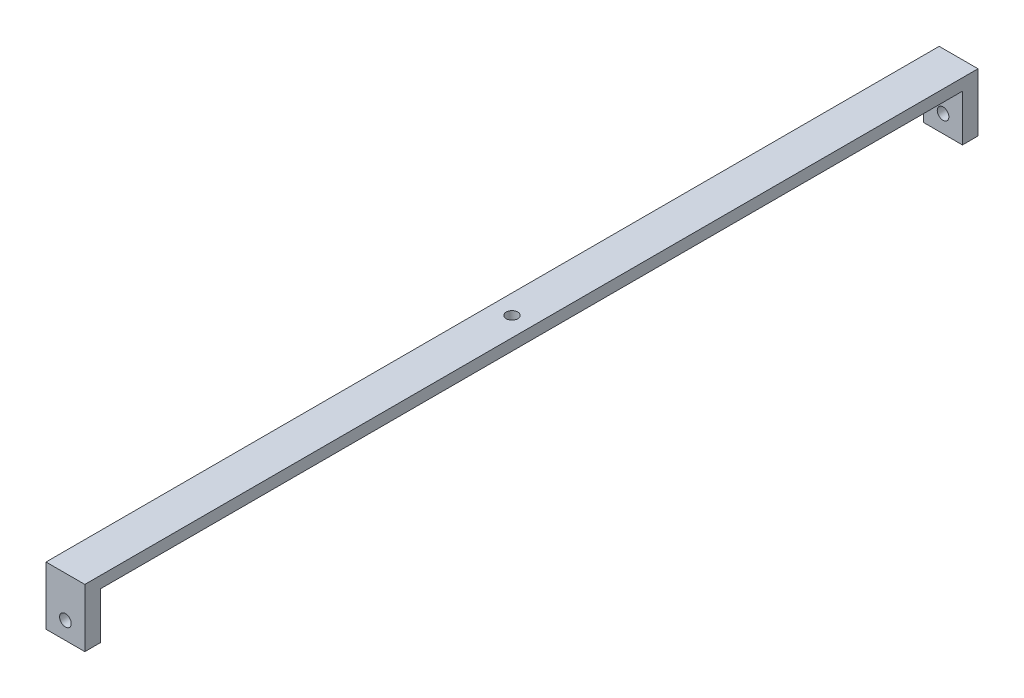
ISO-10303-21;
HEADER;
FILE_DESCRIPTION(('STEP AP214'),'2;1');
FILE_NAME('part.step','',(''),(''),'','','');
FILE_SCHEMA(('AUTOMOTIVE_DESIGN { 1 0 10303 214 1 1 1 1 }'));
ENDSEC;
DATA;
#1=APPLICATION_CONTEXT('core data for automotive mechanical design processes');
#2=APPLICATION_PROTOCOL_DEFINITION('international standard','automotive_design',2000,#1);
#3=PRODUCT_CONTEXT('',#1,'mechanical');
#4=PRODUCT('Part','Part','',(#3));
#5=PRODUCT_RELATED_PRODUCT_CATEGORY('part','',(#4));
#6=PRODUCT_DEFINITION_FORMATION('','',#4);
#7=PRODUCT_DEFINITION_CONTEXT('part definition',#1,'design');
#8=PRODUCT_DEFINITION('design','',#6,#7);
#9=PRODUCT_DEFINITION_SHAPE('','',#8);
#10=(LENGTH_UNIT() NAMED_UNIT(*) SI_UNIT(.MILLI.,.METRE.));
#11=(NAMED_UNIT(*) PLANE_ANGLE_UNIT() SI_UNIT($,.RADIAN.));
#12=(NAMED_UNIT(*) SI_UNIT($,.STERADIAN.) SOLID_ANGLE_UNIT());
#13=UNCERTAINTY_MEASURE_WITH_UNIT(LENGTH_MEASURE(1.E-05),#10,'distance_accuracy_value','');
#14=(GEOMETRIC_REPRESENTATION_CONTEXT(3) GLOBAL_UNCERTAINTY_ASSIGNED_CONTEXT((#13)) GLOBAL_UNIT_ASSIGNED_CONTEXT((#10,
#11,#12)) REPRESENTATION_CONTEXT('',''));
#15=CARTESIAN_POINT('',(0.,0.,0.));
#16=DIRECTION('',(0.,0.,1.));
#17=DIRECTION('',(1.,0.,0.));
#18=AXIS2_PLACEMENT_3D('',#15,#16,#17);
#19=CARTESIAN_POINT('',(-5.,-7.5,115.));
#20=DIRECTION('',(0.,1.,0.));
#21=DIRECTION('',(-1.,0.,0.));
#22=AXIS2_PLACEMENT_3D('',#19,#20,#21);
#23=PLANE('',#22);
#24=DIRECTION('',(0.,0.,-1.));
#25=VECTOR('',#24,1.);
#26=CARTESIAN_POINT('',(-5.,-7.5,115.));
#27=LINE('',#26,#25);
#28=CARTESIAN_POINT('',(-5.,-7.5,115.));
#29=VERTEX_POINT('',#28);
#30=CARTESIAN_POINT('',(-5.,-7.5,111.));
#31=VERTEX_POINT('',#30);
#32=EDGE_CURVE('E189',#29,#31,#27,.T.);
#33=ORIENTED_EDGE('',*,*,#32,.T.);
#34=DIRECTION('',(-1.,0.,0.));
#35=VECTOR('',#34,1.);
#36=CARTESIAN_POINT('',(5.,-7.5,111.));
#37=LINE('',#36,#35);
#38=CARTESIAN_POINT('',(5.,-7.5,111.));
#39=VERTEX_POINT('',#38);
#40=EDGE_CURVE('E159',#39,#31,#37,.T.);
#41=ORIENTED_EDGE('',*,*,#40,.F.);
#42=DIRECTION('',(0.,0.,-1.));
#43=VECTOR('',#42,1.);
#44=CARTESIAN_POINT('',(5.,-7.5,115.));
#45=LINE('',#44,#43);
#46=CARTESIAN_POINT('',(5.,-7.5,115.));
#47=VERTEX_POINT('',#46);
#48=EDGE_CURVE('E149',#47,#39,#45,.T.);
#49=ORIENTED_EDGE('',*,*,#48,.F.);
#50=DIRECTION('',(1.,0.,0.));
#51=VECTOR('',#50,1.);
#52=CARTESIAN_POINT('',(-5.,-7.5,115.));
#53=LINE('',#52,#51);
#54=EDGE_CURVE('E78',#29,#47,#53,.T.);
#55=ORIENTED_EDGE('',*,*,#54,.F.);
#56=EDGE_LOOP('',(#33,#41,#49,#55));
#57=FACE_BOUND('',#56,.T.);
#58=ADVANCED_FACE('F52',(#57),#23,.F.);
#59=CARTESIAN_POINT('',(0.,-3.,115.));
#60=DIRECTION('',(0.,0.,-1.));
#61=DIRECTION('',(-1.,0.,0.));
#62=AXIS2_PLACEMENT_3D('',#59,#60,#61);
#63=CYLINDRICAL_SURFACE('',#62,1.5);
#64=CARTESIAN_POINT('',(0.,-3.,111.));
#65=DIRECTION('',(0.,0.,1.));
#66=DIRECTION('',(1.,0.,0.));
#67=AXIS2_PLACEMENT_3D('',#64,#65,#66);
#68=CIRCLE('',#67,1.5);
#69=CARTESIAN_POINT('',(1.5,-3.,111.));
#70=VERTEX_POINT('',#69);
#71=EDGE_CURVE('E172',#70,#70,#68,.T.);
#72=ORIENTED_EDGE('',*,*,#71,.F.);
#73=EDGE_LOOP('',(#72));
#74=FACE_BOUND('',#73,.T.);
#75=CARTESIAN_POINT('',(0.,-3.,115.));
#76=DIRECTION('',(0.,0.,1.));
#77=DIRECTION('',(1.,0.,0.));
#78=AXIS2_PLACEMENT_3D('',#75,#76,#77);
#79=CIRCLE('',#78,1.5);
#80=CARTESIAN_POINT('',(1.5,-3.,115.));
#81=VERTEX_POINT('',#80);
#82=EDGE_CURVE('E165',#81,#81,#79,.T.);
#83=ORIENTED_EDGE('',*,*,#82,.T.);
#84=EDGE_LOOP('',(#83));
#85=FACE_BOUND('',#84,.T.);
#86=ADVANCED_FACE('F199',(#74,#85),#63,.F.);
#87=CARTESIAN_POINT('',(0.,0.,115.));
#88=DIRECTION('',(0.,0.,-1.));
#89=DIRECTION('',(-1.,0.,0.));
#90=AXIS2_PLACEMENT_3D('',#87,#88,#89);
#91=PLANE('',#90);
#92=DIRECTION('',(0.,1.,0.));
#93=VECTOR('',#92,1.);
#94=CARTESIAN_POINT('',(5.,-7.5,115.));
#95=LINE('',#94,#93);
#96=CARTESIAN_POINT('',(5.,7.5,115.));
#97=VERTEX_POINT('',#96);
#98=EDGE_CURVE('E173',#47,#97,#95,.T.);
#99=ORIENTED_EDGE('',*,*,#98,.T.);
#100=DIRECTION('',(-1.,0.,0.));
#101=VECTOR('',#100,1.);
#102=CARTESIAN_POINT('',(-5.,7.5,115.));
#103=LINE('',#102,#101);
#104=CARTESIAN_POINT('',(-5.,7.5,115.));
#105=VERTEX_POINT('',#104);
#106=EDGE_CURVE('E107',#97,#105,#103,.T.);
#107=ORIENTED_EDGE('',*,*,#106,.T.);
#108=DIRECTION('',(0.,-1.,0.));
#109=VECTOR('',#108,1.);
#110=CARTESIAN_POINT('',(-5.,-7.5,115.));
#111=LINE('',#110,#109);
#112=EDGE_CURVE('E177',#105,#29,#111,.T.);
#113=ORIENTED_EDGE('',*,*,#112,.T.);
#114=ORIENTED_EDGE('',*,*,#54,.T.);
#115=EDGE_LOOP('',(#99,#107,#113,#114));
#116=FACE_BOUND('',#115,.T.);
#117=ORIENTED_EDGE('',*,*,#82,.F.);
#118=EDGE_LOOP('',(#117));
#119=FACE_BOUND('',#118,.T.);
#120=ADVANCED_FACE('F202',(#116,#119),#91,.F.);
#121=CARTESIAN_POINT('',(0.,0.,-115.));
#122=DIRECTION('',(0.,0.,-1.));
#123=DIRECTION('',(-1.,0.,0.));
#124=AXIS2_PLACEMENT_3D('',#121,#122,#123);
#125=PLANE('',#124);
#126=DIRECTION('',(0.,1.,0.));
#127=VECTOR('',#126,1.);
#128=CARTESIAN_POINT('',(5.,-7.5,-115.));
#129=LINE('',#128,#127);
#130=CARTESIAN_POINT('',(5.,-7.5,-115.));
#131=VERTEX_POINT('',#130);
#132=CARTESIAN_POINT('',(5.,7.5,-115.));
#133=VERTEX_POINT('',#132);
#134=EDGE_CURVE('E168',#131,#133,#129,.T.);
#135=ORIENTED_EDGE('',*,*,#134,.F.);
#136=DIRECTION('',(1.,0.,0.));
#137=VECTOR('',#136,1.);
#138=CARTESIAN_POINT('',(-5.,-7.5,-115.));
#139=LINE('',#138,#137);
#140=CARTESIAN_POINT('',(-5.,-7.5,-115.));
#141=VERTEX_POINT('',#140);
#142=EDGE_CURVE('E175',#141,#131,#139,.T.);
#143=ORIENTED_EDGE('',*,*,#142,.F.);
#144=DIRECTION('',(0.,-1.,0.));
#145=VECTOR('',#144,1.);
#146=CARTESIAN_POINT('',(-5.,-7.5,-115.));
#147=LINE('',#146,#145);
#148=CARTESIAN_POINT('',(-5.,7.5,-115.));
#149=VERTEX_POINT('',#148);
#150=EDGE_CURVE('E183',#149,#141,#147,.T.);
#151=ORIENTED_EDGE('',*,*,#150,.F.);
#152=DIRECTION('',(-1.,0.,0.));
#153=VECTOR('',#152,1.);
#154=CARTESIAN_POINT('',(-5.,7.5,-115.));
#155=LINE('',#154,#153);
#156=EDGE_CURVE('E181',#133,#149,#155,.T.);
#157=ORIENTED_EDGE('',*,*,#156,.F.);
#158=EDGE_LOOP('',(#135,#143,#151,#157));
#159=FACE_BOUND('',#158,.T.);
#160=CARTESIAN_POINT('',(0.,-3.,-115.));
#161=DIRECTION('',(0.,0.,1.));
#162=DIRECTION('',(1.,0.,0.));
#163=AXIS2_PLACEMENT_3D('',#160,#161,#162);
#164=CIRCLE('',#163,1.5);
#165=CARTESIAN_POINT('',(1.5,-3.,-115.));
#166=VERTEX_POINT('',#165);
#167=EDGE_CURVE('E169',#166,#166,#164,.T.);
#168=ORIENTED_EDGE('',*,*,#167,.T.);
#169=EDGE_LOOP('',(#168));
#170=FACE_BOUND('',#169,.T.);
#171=ADVANCED_FACE('F208',(#159,#170),#125,.T.);
#172=CARTESIAN_POINT('',(5.,-7.5,115.));
#173=DIRECTION('',(-1.,0.,0.));
#174=DIRECTION('',(0.,-1.,0.));
#175=AXIS2_PLACEMENT_3D('',#172,#173,#174);
#176=PLANE('',#175);
#177=ORIENTED_EDGE('',*,*,#48,.T.);
#178=DIRECTION('',(0.,1.,0.));
#179=VECTOR('',#178,1.);
#180=CARTESIAN_POINT('',(5.,-7.5,111.));
#181=LINE('',#180,#179);
#182=CARTESIAN_POINT('',(5.,4.5,111.));
#183=VERTEX_POINT('',#182);
#184=EDGE_CURVE('E132',#39,#183,#181,.T.);
#185=ORIENTED_EDGE('',*,*,#184,.T.);
#186=DIRECTION('',(0.,0.,-1.));
#187=VECTOR('',#186,1.);
#188=CARTESIAN_POINT('',(5.,4.5,111.));
#189=LINE('',#188,#187);
#190=CARTESIAN_POINT('',(5.,4.49999999999998,-111.));
#191=VERTEX_POINT('',#190);
#192=EDGE_CURVE('E143',#183,#191,#189,.T.);
#193=ORIENTED_EDGE('',*,*,#192,.T.);
#194=DIRECTION('',(0.,-1.,0.));
#195=VECTOR('',#194,1.);
#196=CARTESIAN_POINT('',(5.,-7.50000000000002,-111.));
#197=LINE('',#196,#195);
#198=CARTESIAN_POINT('',(5.,-7.50000000000002,-111.));
#199=VERTEX_POINT('',#198);
#200=EDGE_CURVE('E140',#191,#199,#197,.T.);
#201=ORIENTED_EDGE('',*,*,#200,.T.);
#202=EDGE_CURVE('E100',#199,#131,#45,.T.);
#203=ORIENTED_EDGE('',*,*,#202,.T.);
#204=ORIENTED_EDGE('',*,*,#134,.T.);
#205=DIRECTION('',(0.,0.,-1.));
#206=VECTOR('',#205,1.);
#207=CARTESIAN_POINT('',(5.,7.5,115.));
#208=LINE('',#207,#206);
#209=EDGE_CURVE('E13',#97,#133,#208,.T.);
#210=ORIENTED_EDGE('',*,*,#209,.F.);
#211=ORIENTED_EDGE('',*,*,#98,.F.);
#212=EDGE_LOOP('',(#177,#185,#193,#201,#203,#204,#210,#211));
#213=FACE_BOUND('',#212,.T.);
#214=ADVANCED_FACE('F54',(#213),#176,.F.);
#215=CARTESIAN_POINT('',(-5.,7.5,115.));
#216=DIRECTION('',(0.,-1.,0.));
#217=DIRECTION('',(1.,0.,0.));
#218=AXIS2_PLACEMENT_3D('',#215,#216,#217);
#219=PLANE('',#218);
#220=CARTESIAN_POINT('',(0.,7.5,0.));
#221=DIRECTION('',(0.,1.,0.));
#222=DIRECTION('',(-1.,0.,0.));
#223=AXIS2_PLACEMENT_3D('',#220,#221,#222);
#224=CIRCLE('',#223,1.5);
#225=CARTESIAN_POINT('',(-1.5,7.5,0.));
#226=VERTEX_POINT('',#225);
#227=EDGE_CURVE('E154',#226,#226,#224,.T.);
#228=ORIENTED_EDGE('',*,*,#227,.F.);
#229=EDGE_LOOP('',(#228));
#230=FACE_BOUND('',#229,.T.);
#231=ORIENTED_EDGE('',*,*,#156,.T.);
#232=DIRECTION('',(0.,0.,-1.));
#233=VECTOR('',#232,1.);
#234=CARTESIAN_POINT('',(-5.,7.5,115.));
#235=LINE('',#234,#233);
#236=EDGE_CURVE('E61',#105,#149,#235,.T.);
#237=ORIENTED_EDGE('',*,*,#236,.F.);
#238=ORIENTED_EDGE('',*,*,#106,.F.);
#239=ORIENTED_EDGE('',*,*,#209,.T.);
#240=EDGE_LOOP('',(#231,#237,#238,#239));
#241=FACE_BOUND('',#240,.T.);
#242=ADVANCED_FACE('F230',(#230,#241),#219,.F.);
#243=CARTESIAN_POINT('',(-5.,-7.5,115.));
#244=DIRECTION('',(1.,0.,0.));
#245=DIRECTION('',(0.,1.,0.));
#246=AXIS2_PLACEMENT_3D('',#243,#244,#245);
#247=PLANE('',#246);
#248=DIRECTION('',(0.,0.,-1.));
#249=VECTOR('',#248,1.);
#250=CARTESIAN_POINT('',(-5.,4.5,111.));
#251=LINE('',#250,#249);
#252=CARTESIAN_POINT('',(-5.,4.5,111.));
#253=VERTEX_POINT('',#252);
#254=CARTESIAN_POINT('',(-5.,4.49999999999998,-111.));
#255=VERTEX_POINT('',#254);
#256=EDGE_CURVE('E151',#253,#255,#251,.T.);
#257=ORIENTED_EDGE('',*,*,#256,.F.);
#258=DIRECTION('',(0.,1.,0.));
#259=VECTOR('',#258,1.);
#260=CARTESIAN_POINT('',(-5.,-7.5,111.));
#261=LINE('',#260,#259);
#262=EDGE_CURVE('E135',#31,#253,#261,.T.);
#263=ORIENTED_EDGE('',*,*,#262,.F.);
#264=ORIENTED_EDGE('',*,*,#32,.F.);
#265=ORIENTED_EDGE('',*,*,#112,.F.);
#266=ORIENTED_EDGE('',*,*,#236,.T.);
#267=ORIENTED_EDGE('',*,*,#150,.T.);
#268=CARTESIAN_POINT('',(-5.,-7.5,-111.));
#269=VERTEX_POINT('',#268);
#270=EDGE_CURVE('E188',#269,#141,#27,.T.);
#271=ORIENTED_EDGE('',*,*,#270,.F.);
#272=DIRECTION('',(0.,-1.,0.));
#273=VECTOR('',#272,1.);
#274=CARTESIAN_POINT('',(-5.,-7.50000000000002,-111.));
#275=LINE('',#274,#273);
#276=EDGE_CURVE('E69',#255,#269,#275,.T.);
#277=ORIENTED_EDGE('',*,*,#276,.F.);
#278=EDGE_LOOP('',(#257,#263,#264,#265,#266,#267,#271,#277));
#279=FACE_BOUND('',#278,.T.);
#280=ADVANCED_FACE('F223',(#279),#247,.F.);
#281=ORIENTED_EDGE('',*,*,#202,.F.);
#282=DIRECTION('',(-1.,0.,0.));
#283=VECTOR('',#282,1.);
#284=CARTESIAN_POINT('',(5.,-7.50000000000002,-111.));
#285=LINE('',#284,#283);
#286=EDGE_CURVE('E162',#199,#269,#285,.T.);
#287=ORIENTED_EDGE('',*,*,#286,.T.);
#288=ORIENTED_EDGE('',*,*,#270,.T.);
#289=ORIENTED_EDGE('',*,*,#142,.T.);
#290=EDGE_LOOP('',(#281,#287,#288,#289));
#291=FACE_BOUND('',#290,.T.);
#292=ADVANCED_FACE('F218',(#291),#23,.F.);
#293=CARTESIAN_POINT('',(0.,-3.,-111.));
#294=DIRECTION('',(0.,0.,-1.));
#295=DIRECTION('',(-1.,0.,0.));
#296=AXIS2_PLACEMENT_3D('',#293,#294,#295);
#297=CIRCLE('',#296,1.5);
#298=CARTESIAN_POINT('',(-1.5,-3.,-111.));
#299=VERTEX_POINT('',#298);
#300=EDGE_CURVE('E161',#299,#299,#297,.T.);
#301=ORIENTED_EDGE('',*,*,#300,.F.);
#302=EDGE_LOOP('',(#301));
#303=FACE_BOUND('',#302,.T.);
#304=ORIENTED_EDGE('',*,*,#167,.F.);
#305=EDGE_LOOP('',(#304));
#306=FACE_BOUND('',#305,.T.);
#307=ADVANCED_FACE('F204',(#303,#306),#63,.F.);
#308=CARTESIAN_POINT('',(5.,-7.5,111.));
#309=DIRECTION('',(0.,0.,1.));
#310=DIRECTION('',(1.,0.,0.));
#311=AXIS2_PLACEMENT_3D('',#308,#309,#310);
#312=PLANE('',#311);
#313=ORIENTED_EDGE('',*,*,#71,.T.);
#314=EDGE_LOOP('',(#313));
#315=FACE_BOUND('',#314,.T.);
#316=ORIENTED_EDGE('',*,*,#262,.T.);
#317=DIRECTION('',(-1.,0.,0.));
#318=VECTOR('',#317,1.);
#319=CARTESIAN_POINT('',(5.,4.5,111.));
#320=LINE('',#319,#318);
#321=EDGE_CURVE('E128',#183,#253,#320,.T.);
#322=ORIENTED_EDGE('',*,*,#321,.F.);
#323=ORIENTED_EDGE('',*,*,#184,.F.);
#324=ORIENTED_EDGE('',*,*,#40,.T.);
#325=EDGE_LOOP('',(#316,#322,#323,#324));
#326=FACE_BOUND('',#325,.T.);
#327=ADVANCED_FACE('F130',(#315,#326),#312,.F.);
#328=CARTESIAN_POINT('',(5.,-7.50000000000002,-111.));
#329=DIRECTION('',(0.,0.,-1.));
#330=DIRECTION('',(-1.,0.,0.));
#331=AXIS2_PLACEMENT_3D('',#328,#329,#330);
#332=PLANE('',#331);
#333=ORIENTED_EDGE('',*,*,#300,.T.);
#334=EDGE_LOOP('',(#333));
#335=FACE_BOUND('',#334,.T.);
#336=ORIENTED_EDGE('',*,*,#276,.T.);
#337=ORIENTED_EDGE('',*,*,#286,.F.);
#338=ORIENTED_EDGE('',*,*,#200,.F.);
#339=DIRECTION('',(-1.,0.,0.));
#340=VECTOR('',#339,1.);
#341=CARTESIAN_POINT('',(5.,4.49999999999998,-111.));
#342=LINE('',#341,#340);
#343=EDGE_CURVE('E139',#191,#255,#342,.T.);
#344=ORIENTED_EDGE('',*,*,#343,.T.);
#345=EDGE_LOOP('',(#336,#337,#338,#344));
#346=FACE_BOUND('',#345,.T.);
#347=ADVANCED_FACE('F258',(#335,#346),#332,.F.);
#348=CARTESIAN_POINT('',(5.,4.5,111.));
#349=DIRECTION('',(0.,1.,0.));
#350=DIRECTION('',(0.,0.,1.));
#351=AXIS2_PLACEMENT_3D('',#348,#349,#350);
#352=PLANE('',#351);
#353=CARTESIAN_POINT('',(0.,4.49999999999999,0.));
#354=DIRECTION('',(0.,1.,0.));
#355=DIRECTION('',(0.,0.,1.));
#356=AXIS2_PLACEMENT_3D('',#353,#354,#355);
#357=CIRCLE('',#356,1.5);
#358=CARTESIAN_POINT('',(0.,4.49999999999999,1.5));
#359=VERTEX_POINT('',#358);
#360=EDGE_CURVE('E56',#359,#359,#357,.T.);
#361=ORIENTED_EDGE('',*,*,#360,.T.);
#362=EDGE_LOOP('',(#361));
#363=FACE_BOUND('',#362,.T.);
#364=ORIENTED_EDGE('',*,*,#256,.T.);
#365=ORIENTED_EDGE('',*,*,#343,.F.);
#366=ORIENTED_EDGE('',*,*,#192,.F.);
#367=ORIENTED_EDGE('',*,*,#321,.T.);
#368=EDGE_LOOP('',(#364,#365,#366,#367));
#369=FACE_BOUND('',#368,.T.);
#370=ADVANCED_FACE('F144',(#363,#369),#352,.F.);
#371=CARTESIAN_POINT('',(0.,-2.5,0.));
#372=DIRECTION('',(0.,1.,0.));
#373=DIRECTION('',(-1.,0.,0.));
#374=AXIS2_PLACEMENT_3D('',#371,#372,#373);
#375=CYLINDRICAL_SURFACE('',#374,1.5);
#376=ORIENTED_EDGE('',*,*,#227,.T.);
#377=EDGE_LOOP('',(#376));
#378=FACE_BOUND('',#377,.T.);
#379=ORIENTED_EDGE('',*,*,#360,.F.);
#380=EDGE_LOOP('',(#379));
#381=FACE_BOUND('',#380,.T.);
#382=ADVANCED_FACE('F252',(#378,#381),#375,.F.);
#383=CLOSED_SHELL('',(#58,#86,#120,#171,#214,#242,#280,#292,#307,#327,#347,#370,#382));
#384=MANIFOLD_SOLID_BREP('B2',#383);
#385=ADVANCED_BREP_SHAPE_REPRESENTATION('',(#18,#384),#14);
#386=SHAPE_DEFINITION_REPRESENTATION(#9,#385);
ENDSEC;
END-ISO-10303-21;
